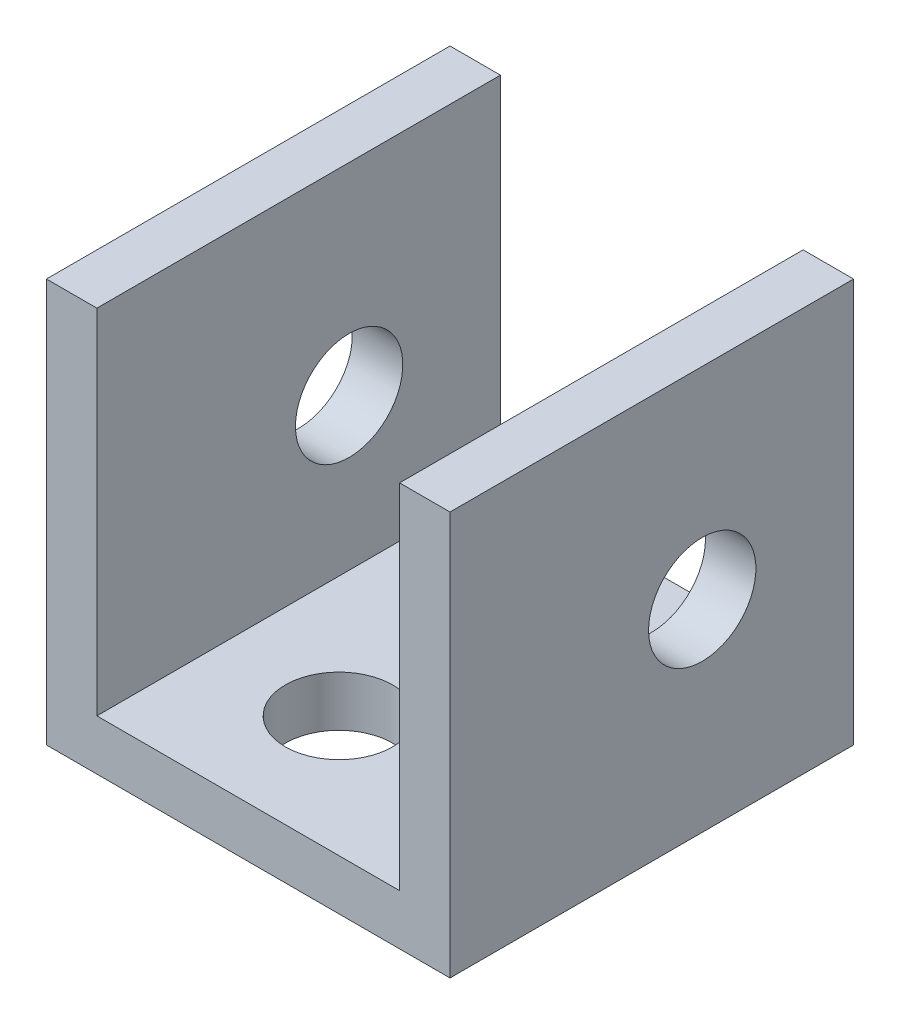
ISO-10303-21;
HEADER;
FILE_DESCRIPTION(('STEP AP214'),'2;1');
FILE_NAME('part.step','',(''),(''),'','','');
FILE_SCHEMA(('AUTOMOTIVE_DESIGN { 1 0 10303 214 1 1 1 1 }'));
ENDSEC;
DATA;
#1=APPLICATION_CONTEXT('core data for automotive mechanical design processes');
#2=APPLICATION_PROTOCOL_DEFINITION('international standard','automotive_design',2000,#1);
#3=PRODUCT_CONTEXT('',#1,'mechanical');
#4=PRODUCT('Part','Part','',(#3));
#5=PRODUCT_RELATED_PRODUCT_CATEGORY('part','',(#4));
#6=PRODUCT_DEFINITION_FORMATION('','',#4);
#7=PRODUCT_DEFINITION_CONTEXT('part definition',#1,'design');
#8=PRODUCT_DEFINITION('design','',#6,#7);
#9=PRODUCT_DEFINITION_SHAPE('','',#8);
#10=(LENGTH_UNIT() NAMED_UNIT(*) SI_UNIT(.MILLI.,.METRE.));
#11=(NAMED_UNIT(*) PLANE_ANGLE_UNIT() SI_UNIT($,.RADIAN.));
#12=(NAMED_UNIT(*) SI_UNIT($,.STERADIAN.) SOLID_ANGLE_UNIT());
#13=UNCERTAINTY_MEASURE_WITH_UNIT(LENGTH_MEASURE(1.E-05),#10,'distance_accuracy_value','');
#14=(GEOMETRIC_REPRESENTATION_CONTEXT(3) GLOBAL_UNCERTAINTY_ASSIGNED_CONTEXT((#13)) GLOBAL_UNIT_ASSIGNED_CONTEXT((#10,
#11,#12)) REPRESENTATION_CONTEXT('',''));
#15=CARTESIAN_POINT('',(0.,0.,0.));
#16=DIRECTION('',(0.,0.,1.));
#17=DIRECTION('',(1.,0.,0.));
#18=AXIS2_PLACEMENT_3D('',#15,#16,#17);
#19=CARTESIAN_POINT('',(0.,3.175,0.));
#20=DIRECTION('',(0.,-1.,0.));
#21=DIRECTION('',(0.,0.,-1.));
#22=AXIS2_PLACEMENT_3D('',#19,#20,#21);
#23=PLANE('',#22);
#24=CARTESIAN_POINT('',(1.90499999999999,3.175,-5.08));
#25=DIRECTION('',(0.,1.,0.));
#26=DIRECTION('',(0.,0.,1.));
#27=AXIS2_PLACEMENT_3D('',#24,#25,#26);
#28=CIRCLE('',#27,3.3782);
#29=CARTESIAN_POINT('',(1.90499999999999,3.175,-1.7018));
#30=VERTEX_POINT('',#29);
#31=EDGE_CURVE('E295',#30,#30,#28,.T.);
#32=ORIENTED_EDGE('',*,*,#31,.F.);
#33=EDGE_LOOP('',(#32));
#34=FACE_BOUND('',#33,.T.);
#35=CARTESIAN_POINT('',(-1.905,3.175,5.08));
#36=DIRECTION('',(0.,1.,0.));
#37=DIRECTION('',(0.,0.,1.));
#38=AXIS2_PLACEMENT_3D('',#35,#36,#37);
#39=CIRCLE('',#38,3.3782);
#40=CARTESIAN_POINT('',(-1.905,3.175,8.4582));
#41=VERTEX_POINT('',#40);
#42=EDGE_CURVE('E306',#41,#41,#39,.T.);
#43=ORIENTED_EDGE('',*,*,#42,.F.);
#44=EDGE_LOOP('',(#43));
#45=FACE_BOUND('',#44,.T.);
#46=DIRECTION('',(0.,0.,-1.));
#47=VECTOR('',#46,1.);
#48=CARTESIAN_POINT('',(-9.525,3.175,12.7));
#49=LINE('',#48,#47);
#50=CARTESIAN_POINT('',(-9.525,3.175,12.7));
#51=VERTEX_POINT('',#50);
#52=CARTESIAN_POINT('',(-9.525,3.175,-12.7));
#53=VERTEX_POINT('',#52);
#54=EDGE_CURVE('E59',#51,#53,#49,.T.);
#55=ORIENTED_EDGE('',*,*,#54,.F.);
#56=DIRECTION('',(1.,0.,0.));
#57=VECTOR('',#56,1.);
#58=CARTESIAN_POINT('',(-12.7,3.175,12.7));
#59=LINE('',#58,#57);
#60=CARTESIAN_POINT('',(9.525,3.175,12.7));
#61=VERTEX_POINT('',#60);
#62=EDGE_CURVE('E163',#51,#61,#59,.T.);
#63=ORIENTED_EDGE('',*,*,#62,.T.);
#64=DIRECTION('',(0.,0.,1.));
#65=VECTOR('',#64,1.);
#66=CARTESIAN_POINT('',(9.52499999999999,3.175,-12.7));
#67=LINE('',#66,#65);
#68=CARTESIAN_POINT('',(9.52499999999999,3.175,-12.7));
#69=VERTEX_POINT('',#68);
#70=EDGE_CURVE('E64',#69,#61,#67,.T.);
#71=ORIENTED_EDGE('',*,*,#70,.F.);
#72=DIRECTION('',(-1.,0.,0.));
#73=VECTOR('',#72,1.);
#74=CARTESIAN_POINT('',(-12.7,3.175,-12.7));
#75=LINE('',#74,#73);
#76=EDGE_CURVE('E161',#69,#53,#75,.T.);
#77=ORIENTED_EDGE('',*,*,#76,.T.);
#78=EDGE_LOOP('',(#55,#63,#71,#77));
#79=FACE_BOUND('',#78,.T.);
#80=ADVANCED_FACE('F43',(#34,#45,#79),#23,.F.);
#81=CARTESIAN_POINT('',(12.7,3.175,12.7));
#82=DIRECTION('',(-1.,0.,0.));
#83=DIRECTION('',(0.,0.,1.));
#84=AXIS2_PLACEMENT_3D('',#81,#82,#83);
#85=PLANE('',#84);
#86=CARTESIAN_POINT('',(12.7,12.7,-3.175));
#87=DIRECTION('',(-1.,0.,0.));
#88=DIRECTION('',(0.,0.,1.));
#89=AXIS2_PLACEMENT_3D('',#86,#87,#88);
#90=CIRCLE('',#89,3.37819999999999);
#91=CARTESIAN_POINT('',(12.7,12.7,0.203199999999995));
#92=VERTEX_POINT('',#91);
#93=EDGE_CURVE('E301',#92,#92,#90,.T.);
#94=ORIENTED_EDGE('',*,*,#93,.T.);
#95=EDGE_LOOP('',(#94));
#96=FACE_BOUND('',#95,.T.);
#97=DIRECTION('',(0.,0.,-1.));
#98=VECTOR('',#97,1.);
#99=CARTESIAN_POINT('',(12.7,0.,12.7));
#100=LINE('',#99,#98);
#101=CARTESIAN_POINT('',(12.7,0.,12.7));
#102=VERTEX_POINT('',#101);
#103=CARTESIAN_POINT('',(12.7,0.,-12.7));
#104=VERTEX_POINT('',#103);
#105=EDGE_CURVE('E143',#102,#104,#100,.T.);
#106=ORIENTED_EDGE('',*,*,#105,.T.);
#107=DIRECTION('',(0.,-1.,0.));
#108=VECTOR('',#107,1.);
#109=CARTESIAN_POINT('',(12.7,3.175,-12.7));
#110=LINE('',#109,#108);
#111=CARTESIAN_POINT('',(12.7,25.4,-12.7));
#112=VERTEX_POINT('',#111);
#113=EDGE_CURVE('E11',#112,#104,#110,.T.);
#114=ORIENTED_EDGE('',*,*,#113,.F.);
#115=DIRECTION('',(0.,0.,-1.));
#116=VECTOR('',#115,1.);
#117=CARTESIAN_POINT('',(12.7,25.4,12.7));
#118=LINE('',#117,#116);
#119=CARTESIAN_POINT('',(12.7,25.4,12.7));
#120=VERTEX_POINT('',#119);
#121=EDGE_CURVE('E152',#120,#112,#118,.T.);
#122=ORIENTED_EDGE('',*,*,#121,.F.);
#123=DIRECTION('',(0.,-1.,0.));
#124=VECTOR('',#123,1.);
#125=CARTESIAN_POINT('',(12.7,3.175,12.7));
#126=LINE('',#125,#124);
#127=EDGE_CURVE('E166',#120,#102,#126,.T.);
#128=ORIENTED_EDGE('',*,*,#127,.T.);
#129=EDGE_LOOP('',(#106,#114,#122,#128));
#130=FACE_BOUND('',#129,.T.);
#131=ADVANCED_FACE('F45',(#96,#130),#85,.F.);
#132=CARTESIAN_POINT('',(-12.7,3.175,-12.7));
#133=DIRECTION('',(0.,0.,1.));
#134=DIRECTION('',(1.,0.,0.));
#135=AXIS2_PLACEMENT_3D('',#132,#133,#134);
#136=PLANE('',#135);
#137=DIRECTION('',(-1.,0.,0.));
#138=VECTOR('',#137,1.);
#139=CARTESIAN_POINT('',(-12.7,0.,-12.7));
#140=LINE('',#139,#138);
#141=CARTESIAN_POINT('',(-12.7,0.,-12.7));
#142=VERTEX_POINT('',#141);
#143=EDGE_CURVE('E113',#104,#142,#140,.T.);
#144=ORIENTED_EDGE('',*,*,#143,.T.);
#145=DIRECTION('',(0.,-1.,0.));
#146=VECTOR('',#145,1.);
#147=CARTESIAN_POINT('',(-12.7,3.175,-12.7));
#148=LINE('',#147,#146);
#149=CARTESIAN_POINT('',(-12.7,25.4,-12.7));
#150=VERTEX_POINT('',#149);
#151=EDGE_CURVE('E52',#150,#142,#148,.T.);
#152=ORIENTED_EDGE('',*,*,#151,.F.);
#153=DIRECTION('',(-1.,0.,0.));
#154=VECTOR('',#153,1.);
#155=CARTESIAN_POINT('',(-9.525,25.4,-12.7));
#156=LINE('',#155,#154);
#157=CARTESIAN_POINT('',(-9.525,25.4,-12.7));
#158=VERTEX_POINT('',#157);
#159=EDGE_CURVE('E112',#158,#150,#156,.T.);
#160=ORIENTED_EDGE('',*,*,#159,.F.);
#161=DIRECTION('',(0.,-1.,0.));
#162=VECTOR('',#161,1.);
#163=CARTESIAN_POINT('',(-9.525,25.4,-12.7));
#164=LINE('',#163,#162);
#165=EDGE_CURVE('E137',#158,#53,#164,.T.);
#166=ORIENTED_EDGE('',*,*,#165,.T.);
#167=ORIENTED_EDGE('',*,*,#76,.F.);
#168=DIRECTION('',(0.,-1.,0.));
#169=VECTOR('',#168,1.);
#170=CARTESIAN_POINT('',(9.52499999999999,25.4,-12.7));
#171=LINE('',#170,#169);
#172=CARTESIAN_POINT('',(9.52499999999999,25.4,-12.7));
#173=VERTEX_POINT('',#172);
#174=EDGE_CURVE('E144',#173,#69,#171,.T.);
#175=ORIENTED_EDGE('',*,*,#174,.F.);
#176=DIRECTION('',(-1.,0.,0.));
#177=VECTOR('',#176,1.);
#178=CARTESIAN_POINT('',(12.7,25.4,-12.7));
#179=LINE('',#178,#177);
#180=EDGE_CURVE('E157',#112,#173,#179,.T.);
#181=ORIENTED_EDGE('',*,*,#180,.F.);
#182=ORIENTED_EDGE('',*,*,#113,.T.);
#183=EDGE_LOOP('',(#144,#152,#160,#166,#167,#175,#181,#182));
#184=FACE_BOUND('',#183,.T.);
#185=ADVANCED_FACE('F109',(#184),#136,.F.);
#186=CARTESIAN_POINT('',(-12.7,3.175,12.7));
#187=DIRECTION('',(1.,0.,0.));
#188=DIRECTION('',(0.,0.,-1.));
#189=AXIS2_PLACEMENT_3D('',#186,#187,#188);
#190=PLANE('',#189);
#191=CARTESIAN_POINT('',(-12.7,12.7,-3.175));
#192=DIRECTION('',(-1.,0.,0.));
#193=DIRECTION('',(0.,0.,1.));
#194=AXIS2_PLACEMENT_3D('',#191,#192,#193);
#195=CIRCLE('',#194,3.37819999999999);
#196=CARTESIAN_POINT('',(-12.7,12.7,0.203199999999995));
#197=VERTEX_POINT('',#196);
#198=EDGE_CURVE('E316',#197,#197,#195,.T.);
#199=ORIENTED_EDGE('',*,*,#198,.F.);
#200=EDGE_LOOP('',(#199));
#201=FACE_BOUND('',#200,.T.);
#202=DIRECTION('',(0.,0.,1.));
#203=VECTOR('',#202,1.);
#204=CARTESIAN_POINT('',(-12.7,0.,12.7));
#205=LINE('',#204,#203);
#206=CARTESIAN_POINT('',(-12.7,0.,12.7));
#207=VERTEX_POINT('',#206);
#208=EDGE_CURVE('E170',#142,#207,#205,.T.);
#209=ORIENTED_EDGE('',*,*,#208,.T.);
#210=DIRECTION('',(0.,-1.,0.));
#211=VECTOR('',#210,1.);
#212=CARTESIAN_POINT('',(-12.7,3.175,12.7));
#213=LINE('',#212,#211);
#214=CARTESIAN_POINT('',(-12.7,25.4,12.7));
#215=VERTEX_POINT('',#214);
#216=EDGE_CURVE('E116',#215,#207,#213,.T.);
#217=ORIENTED_EDGE('',*,*,#216,.F.);
#218=DIRECTION('',(0.,0.,1.));
#219=VECTOR('',#218,1.);
#220=CARTESIAN_POINT('',(-12.7,25.4,-12.7));
#221=LINE('',#220,#219);
#222=EDGE_CURVE('E119',#150,#215,#221,.T.);
#223=ORIENTED_EDGE('',*,*,#222,.F.);
#224=ORIENTED_EDGE('',*,*,#151,.T.);
#225=EDGE_LOOP('',(#209,#217,#223,#224));
#226=FACE_BOUND('',#225,.T.);
#227=ADVANCED_FACE('F120',(#201,#226),#190,.F.);
#228=CARTESIAN_POINT('',(-12.7,3.175,12.7));
#229=DIRECTION('',(0.,0.,-1.));
#230=DIRECTION('',(-1.,0.,0.));
#231=AXIS2_PLACEMENT_3D('',#228,#229,#230);
#232=PLANE('',#231);
#233=DIRECTION('',(1.,0.,0.));
#234=VECTOR('',#233,1.);
#235=CARTESIAN_POINT('',(-12.7,0.,12.7));
#236=LINE('',#235,#234);
#237=EDGE_CURVE('E164',#207,#102,#236,.T.);
#238=ORIENTED_EDGE('',*,*,#237,.T.);
#239=ORIENTED_EDGE('',*,*,#127,.F.);
#240=DIRECTION('',(1.,0.,0.));
#241=VECTOR('',#240,1.);
#242=CARTESIAN_POINT('',(9.525,25.4,12.7));
#243=LINE('',#242,#241);
#244=CARTESIAN_POINT('',(9.525,25.4,12.7));
#245=VERTEX_POINT('',#244);
#246=EDGE_CURVE('E150',#245,#120,#243,.T.);
#247=ORIENTED_EDGE('',*,*,#246,.F.);
#248=DIRECTION('',(0.,-1.,0.));
#249=VECTOR('',#248,1.);
#250=CARTESIAN_POINT('',(9.525,25.4,12.7));
#251=LINE('',#250,#249);
#252=EDGE_CURVE('E147',#245,#61,#251,.T.);
#253=ORIENTED_EDGE('',*,*,#252,.T.);
#254=ORIENTED_EDGE('',*,*,#62,.F.);
#255=DIRECTION('',(0.,-1.,0.));
#256=VECTOR('',#255,1.);
#257=CARTESIAN_POINT('',(-9.525,25.4,12.7));
#258=LINE('',#257,#256);
#259=CARTESIAN_POINT('',(-9.525,25.4,12.7));
#260=VERTEX_POINT('',#259);
#261=EDGE_CURVE('E140',#260,#51,#258,.T.);
#262=ORIENTED_EDGE('',*,*,#261,.F.);
#263=DIRECTION('',(1.,0.,0.));
#264=VECTOR('',#263,1.);
#265=CARTESIAN_POINT('',(-12.7,25.4,12.7));
#266=LINE('',#265,#264);
#267=EDGE_CURVE('E124',#215,#260,#266,.T.);
#268=ORIENTED_EDGE('',*,*,#267,.F.);
#269=ORIENTED_EDGE('',*,*,#216,.T.);
#270=EDGE_LOOP('',(#238,#239,#247,#253,#254,#262,#268,#269));
#271=FACE_BOUND('',#270,.T.);
#272=ADVANCED_FACE('F177',(#271),#232,.F.);
#273=CARTESIAN_POINT('',(0.,0.,0.));
#274=DIRECTION('',(0.,-1.,0.));
#275=DIRECTION('',(0.,0.,-1.));
#276=AXIS2_PLACEMENT_3D('',#273,#274,#275);
#277=PLANE('',#276);
#278=CARTESIAN_POINT('',(1.90499999999999,0.,-5.08));
#279=DIRECTION('',(0.,1.,0.));
#280=DIRECTION('',(0.,0.,1.));
#281=AXIS2_PLACEMENT_3D('',#278,#279,#280);
#282=CIRCLE('',#281,3.3782);
#283=CARTESIAN_POINT('',(1.90499999999999,0.,-1.7018));
#284=VERTEX_POINT('',#283);
#285=EDGE_CURVE('E298',#284,#284,#282,.T.);
#286=ORIENTED_EDGE('',*,*,#285,.T.);
#287=EDGE_LOOP('',(#286));
#288=FACE_BOUND('',#287,.T.);
#289=CARTESIAN_POINT('',(-1.905,0.,5.08));
#290=DIRECTION('',(0.,1.,0.));
#291=DIRECTION('',(0.,0.,1.));
#292=AXIS2_PLACEMENT_3D('',#289,#290,#291);
#293=CIRCLE('',#292,3.3782);
#294=CARTESIAN_POINT('',(-1.905,0.,8.4582));
#295=VERTEX_POINT('',#294);
#296=EDGE_CURVE('E133',#295,#295,#293,.T.);
#297=ORIENTED_EDGE('',*,*,#296,.T.);
#298=EDGE_LOOP('',(#297));
#299=FACE_BOUND('',#298,.T.);
#300=ORIENTED_EDGE('',*,*,#105,.F.);
#301=ORIENTED_EDGE('',*,*,#237,.F.);
#302=ORIENTED_EDGE('',*,*,#208,.F.);
#303=ORIENTED_EDGE('',*,*,#143,.F.);
#304=EDGE_LOOP('',(#300,#301,#302,#303));
#305=FACE_BOUND('',#304,.T.);
#306=ADVANCED_FACE('F181',(#288,#299,#305),#277,.T.);
#307=CARTESIAN_POINT('',(9.52499999999999,25.4,-12.7));
#308=DIRECTION('',(1.,0.,0.));
#309=DIRECTION('',(0.,0.,-1.));
#310=AXIS2_PLACEMENT_3D('',#307,#308,#309);
#311=PLANE('',#310);
#312=CARTESIAN_POINT('',(9.52499999999999,12.7,-3.175));
#313=DIRECTION('',(1.,0.,0.));
#314=DIRECTION('',(0.,0.,-1.));
#315=AXIS2_PLACEMENT_3D('',#312,#313,#314);
#316=CIRCLE('',#315,3.37819999999999);
#317=CARTESIAN_POINT('',(9.52499999999999,12.7,-6.55319999999999));
#318=VERTEX_POINT('',#317);
#319=EDGE_CURVE('E294',#318,#318,#316,.T.);
#320=ORIENTED_EDGE('',*,*,#319,.T.);
#321=EDGE_LOOP('',(#320));
#322=FACE_BOUND('',#321,.T.);
#323=ORIENTED_EDGE('',*,*,#70,.T.);
#324=ORIENTED_EDGE('',*,*,#252,.F.);
#325=DIRECTION('',(0.,0.,1.));
#326=VECTOR('',#325,1.);
#327=CARTESIAN_POINT('',(9.52499999999999,25.4,-12.7));
#328=LINE('',#327,#326);
#329=EDGE_CURVE('E155',#173,#245,#328,.T.);
#330=ORIENTED_EDGE('',*,*,#329,.F.);
#331=ORIENTED_EDGE('',*,*,#174,.T.);
#332=EDGE_LOOP('',(#323,#324,#330,#331));
#333=FACE_BOUND('',#332,.T.);
#334=ADVANCED_FACE('F192',(#322,#333),#311,.F.);
#335=CARTESIAN_POINT('',(0.,25.4,0.));
#336=DIRECTION('',(0.,1.,0.));
#337=DIRECTION('',(0.,0.,1.));
#338=AXIS2_PLACEMENT_3D('',#335,#336,#337);
#339=PLANE('',#338);
#340=ORIENTED_EDGE('',*,*,#121,.T.);
#341=ORIENTED_EDGE('',*,*,#180,.T.);
#342=ORIENTED_EDGE('',*,*,#329,.T.);
#343=ORIENTED_EDGE('',*,*,#246,.T.);
#344=EDGE_LOOP('',(#340,#341,#342,#343));
#345=FACE_BOUND('',#344,.T.);
#346=ADVANCED_FACE('F187',(#345),#339,.T.);
#347=CARTESIAN_POINT('',(-9.525,25.4,12.7));
#348=DIRECTION('',(-1.,0.,0.));
#349=DIRECTION('',(0.,0.,1.));
#350=AXIS2_PLACEMENT_3D('',#347,#348,#349);
#351=PLANE('',#350);
#352=CARTESIAN_POINT('',(-9.525,12.7,-3.175));
#353=DIRECTION('',(-1.,0.,0.));
#354=DIRECTION('',(0.,0.,1.));
#355=AXIS2_PLACEMENT_3D('',#352,#353,#354);
#356=CIRCLE('',#355,3.37819999999999);
#357=CARTESIAN_POINT('',(-9.525,12.7,0.203199999999995));
#358=VERTEX_POINT('',#357);
#359=EDGE_CURVE('E47',#358,#358,#356,.T.);
#360=ORIENTED_EDGE('',*,*,#359,.T.);
#361=EDGE_LOOP('',(#360));
#362=FACE_BOUND('',#361,.T.);
#363=ORIENTED_EDGE('',*,*,#54,.T.);
#364=ORIENTED_EDGE('',*,*,#165,.F.);
#365=DIRECTION('',(0.,0.,-1.));
#366=VECTOR('',#365,1.);
#367=CARTESIAN_POINT('',(-9.525,25.4,12.7));
#368=LINE('',#367,#366);
#369=EDGE_CURVE('E128',#260,#158,#368,.T.);
#370=ORIENTED_EDGE('',*,*,#369,.F.);
#371=ORIENTED_EDGE('',*,*,#261,.T.);
#372=EDGE_LOOP('',(#363,#364,#370,#371));
#373=FACE_BOUND('',#372,.T.);
#374=ADVANCED_FACE('F194',(#362,#373),#351,.F.);
#375=CARTESIAN_POINT('',(0.,25.4,0.));
#376=DIRECTION('',(0.,1.,0.));
#377=DIRECTION('',(0.,0.,1.));
#378=AXIS2_PLACEMENT_3D('',#375,#376,#377);
#379=PLANE('',#378);
#380=ORIENTED_EDGE('',*,*,#159,.T.);
#381=ORIENTED_EDGE('',*,*,#222,.T.);
#382=ORIENTED_EDGE('',*,*,#267,.T.);
#383=ORIENTED_EDGE('',*,*,#369,.T.);
#384=EDGE_LOOP('',(#380,#381,#382,#383));
#385=FACE_BOUND('',#384,.T.);
#386=ADVANCED_FACE('F126',(#385),#379,.T.);
#387=CARTESIAN_POINT('',(-1.905,3.175,5.08));
#388=DIRECTION('',(0.,1.,0.));
#389=DIRECTION('',(0.,0.,1.));
#390=AXIS2_PLACEMENT_3D('',#387,#388,#389);
#391=CYLINDRICAL_SURFACE('',#390,3.3782);
#392=ORIENTED_EDGE('',*,*,#296,.F.);
#393=EDGE_LOOP('',(#392));
#394=FACE_BOUND('',#393,.T.);
#395=ORIENTED_EDGE('',*,*,#42,.T.);
#396=EDGE_LOOP('',(#395));
#397=FACE_BOUND('',#396,.T.);
#398=ADVANCED_FACE('F237',(#394,#397),#391,.F.);
#399=CARTESIAN_POINT('',(1.90499999999999,3.175,-5.08));
#400=DIRECTION('',(0.,1.,0.));
#401=DIRECTION('',(0.,0.,1.));
#402=AXIS2_PLACEMENT_3D('',#399,#400,#401);
#403=CYLINDRICAL_SURFACE('',#402,3.3782);
#404=ORIENTED_EDGE('',*,*,#285,.F.);
#405=EDGE_LOOP('',(#404));
#406=FACE_BOUND('',#405,.T.);
#407=ORIENTED_EDGE('',*,*,#31,.T.);
#408=EDGE_LOOP('',(#407));
#409=FACE_BOUND('',#408,.T.);
#410=ADVANCED_FACE('F253',(#406,#409),#403,.F.);
#411=CARTESIAN_POINT('',(-12.7,12.7,-3.175));
#412=DIRECTION('',(-1.,0.,0.));
#413=DIRECTION('',(0.,0.,1.));
#414=AXIS2_PLACEMENT_3D('',#411,#412,#413);
#415=CYLINDRICAL_SURFACE('',#414,3.37819999999999);
#416=ORIENTED_EDGE('',*,*,#198,.T.);
#417=EDGE_LOOP('',(#416));
#418=FACE_BOUND('',#417,.T.);
#419=ORIENTED_EDGE('',*,*,#359,.F.);
#420=EDGE_LOOP('',(#419));
#421=FACE_BOUND('',#420,.T.);
#422=ADVANCED_FACE('F263',(#418,#421),#415,.F.);
#423=ORIENTED_EDGE('',*,*,#93,.F.);
#424=EDGE_LOOP('',(#423));
#425=FACE_BOUND('',#424,.T.);
#426=ORIENTED_EDGE('',*,*,#319,.F.);
#427=EDGE_LOOP('',(#426));
#428=FACE_BOUND('',#427,.T.);
#429=ADVANCED_FACE('F273',(#425,#428),#415,.F.);
#430=CLOSED_SHELL('',(#80,#131,#185,#227,#272,#306,#334,#346,#374,#386,#398,#410,#422,#429));
#431=MANIFOLD_SOLID_BREP('B2',#430);
#432=ADVANCED_BREP_SHAPE_REPRESENTATION('',(#18,#431),#14);
#433=SHAPE_DEFINITION_REPRESENTATION(#9,#432);
ENDSEC;
END-ISO-10303-21;
